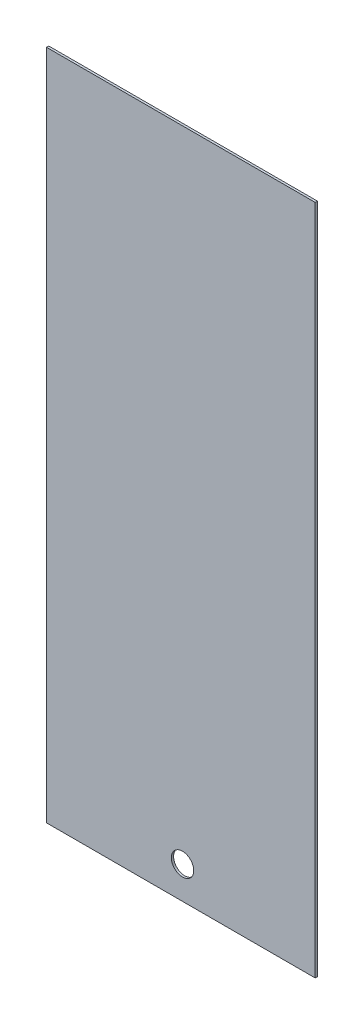
ISO-10303-21;
HEADER;
FILE_DESCRIPTION(('STEP AP214'),'2;1');
FILE_NAME('part.step','',(''),(''),'','','');
FILE_SCHEMA(('AUTOMOTIVE_DESIGN { 1 0 10303 214 1 1 1 1 }'));
ENDSEC;
DATA;
#1=APPLICATION_CONTEXT('core data for automotive mechanical design processes');
#2=APPLICATION_PROTOCOL_DEFINITION('international standard','automotive_design',2000,#1);
#3=PRODUCT_CONTEXT('',#1,'mechanical');
#4=PRODUCT('Part','Part','',(#3));
#5=PRODUCT_RELATED_PRODUCT_CATEGORY('part','',(#4));
#6=PRODUCT_DEFINITION_FORMATION('','',#4);
#7=PRODUCT_DEFINITION_CONTEXT('part definition',#1,'design');
#8=PRODUCT_DEFINITION('design','',#6,#7);
#9=PRODUCT_DEFINITION_SHAPE('','',#8);
#10=(LENGTH_UNIT() NAMED_UNIT(*) SI_UNIT(.MILLI.,.METRE.));
#11=(NAMED_UNIT(*) PLANE_ANGLE_UNIT() SI_UNIT($,.RADIAN.));
#12=(NAMED_UNIT(*) SI_UNIT($,.STERADIAN.) SOLID_ANGLE_UNIT());
#13=UNCERTAINTY_MEASURE_WITH_UNIT(LENGTH_MEASURE(1.E-05),#10,'distance_accuracy_value','');
#14=(GEOMETRIC_REPRESENTATION_CONTEXT(3) GLOBAL_UNCERTAINTY_ASSIGNED_CONTEXT((#13)) GLOBAL_UNIT_ASSIGNED_CONTEXT((#10,
#11,#12)) REPRESENTATION_CONTEXT('',''));
#15=CARTESIAN_POINT('',(0.,0.,0.));
#16=DIRECTION('',(0.,0.,1.));
#17=DIRECTION('',(1.,0.,0.));
#18=AXIS2_PLACEMENT_3D('',#15,#16,#17);
#19=CARTESIAN_POINT('',(-177.468407310705,180.253785900783,2.54));
#20=DIRECTION('',(1.,0.,0.));
#21=DIRECTION('',(0.,1.,0.));
#22=AXIS2_PLACEMENT_3D('',#19,#20,#21);
#23=PLANE('',#22);
#24=DIRECTION('',(0.,-1.,0.));
#25=VECTOR('',#24,1.);
#26=CARTESIAN_POINT('',(-177.468407310705,180.253785900783,0.));
#27=LINE('',#26,#25);
#28=CARTESIAN_POINT('',(-177.468407310705,180.253785900783,0.));
#29=VERTEX_POINT('',#28);
#30=CARTESIAN_POINT('',(-177.468407310705,-581.746214099217,0.));
#31=VERTEX_POINT('',#30);
#32=EDGE_CURVE('E96',#29,#31,#27,.T.);
#33=ORIENTED_EDGE('',*,*,#32,.T.);
#34=DIRECTION('',(0.,0.,-1.));
#35=VECTOR('',#34,1.);
#36=CARTESIAN_POINT('',(-177.468407310705,-581.746214099217,2.54));
#37=LINE('',#36,#35);
#38=CARTESIAN_POINT('',(-177.468407310705,-581.746214099217,2.54));
#39=VERTEX_POINT('',#38);
#40=EDGE_CURVE('E11',#39,#31,#37,.T.);
#41=ORIENTED_EDGE('',*,*,#40,.F.);
#42=DIRECTION('',(0.,-1.,0.));
#43=VECTOR('',#42,1.);
#44=CARTESIAN_POINT('',(-177.468407310705,180.253785900783,2.54));
#45=LINE('',#44,#43);
#46=CARTESIAN_POINT('',(-177.468407310705,180.253785900783,2.54));
#47=VERTEX_POINT('',#46);
#48=EDGE_CURVE('E84',#47,#39,#45,.T.);
#49=ORIENTED_EDGE('',*,*,#48,.F.);
#50=DIRECTION('',(0.,0.,-1.));
#51=VECTOR('',#50,1.);
#52=CARTESIAN_POINT('',(-177.468407310705,180.253785900783,2.54));
#53=LINE('',#52,#51);
#54=EDGE_CURVE('E92',#47,#29,#53,.T.);
#55=ORIENTED_EDGE('',*,*,#54,.T.);
#56=EDGE_LOOP('',(#33,#41,#49,#55));
#57=FACE_BOUND('',#56,.T.);
#58=ADVANCED_FACE('F33',(#57),#23,.F.);
#59=CARTESIAN_POINT('',(-177.468407310705,-581.746214099217,2.54));
#60=DIRECTION('',(0.,1.,0.));
#61=DIRECTION('',(0.,0.,1.));
#62=AXIS2_PLACEMENT_3D('',#59,#60,#61);
#63=PLANE('',#62);
#64=DIRECTION('',(1.,0.,0.));
#65=VECTOR('',#64,1.);
#66=CARTESIAN_POINT('',(-177.468407310705,-581.746214099217,0.));
#67=LINE('',#66,#65);
#68=CARTESIAN_POINT('',(127.331592689295,-581.746214099217,0.));
#69=VERTEX_POINT('',#68);
#70=EDGE_CURVE('E88',#31,#69,#67,.T.);
#71=ORIENTED_EDGE('',*,*,#70,.T.);
#72=DIRECTION('',(0.,0.,-1.));
#73=VECTOR('',#72,1.);
#74=CARTESIAN_POINT('',(127.331592689295,-581.746214099217,2.54));
#75=LINE('',#74,#73);
#76=CARTESIAN_POINT('',(127.331592689295,-581.746214099217,2.54));
#77=VERTEX_POINT('',#76);
#78=EDGE_CURVE('E41',#77,#69,#75,.T.);
#79=ORIENTED_EDGE('',*,*,#78,.F.);
#80=DIRECTION('',(1.,0.,0.));
#81=VECTOR('',#80,1.);
#82=CARTESIAN_POINT('',(-177.468407310705,-581.746214099217,2.54));
#83=LINE('',#82,#81);
#84=EDGE_CURVE('E79',#39,#77,#83,.T.);
#85=ORIENTED_EDGE('',*,*,#84,.F.);
#86=ORIENTED_EDGE('',*,*,#40,.T.);
#87=EDGE_LOOP('',(#71,#79,#85,#86));
#88=FACE_BOUND('',#87,.T.);
#89=ADVANCED_FACE('F87',(#88),#63,.F.);
#90=CARTESIAN_POINT('',(127.331592689295,180.253785900783,2.54));
#91=DIRECTION('',(-1.,0.,0.));
#92=DIRECTION('',(0.,-1.,0.));
#93=AXIS2_PLACEMENT_3D('',#90,#91,#92);
#94=PLANE('',#93);
#95=DIRECTION('',(0.,1.,0.));
#96=VECTOR('',#95,1.);
#97=CARTESIAN_POINT('',(127.331592689295,180.253785900783,0.));
#98=LINE('',#97,#96);
#99=CARTESIAN_POINT('',(127.331592689295,180.253785900783,0.));
#100=VERTEX_POINT('',#99);
#101=EDGE_CURVE('E66',#69,#100,#98,.T.);
#102=ORIENTED_EDGE('',*,*,#101,.T.);
#103=DIRECTION('',(0.,0.,-1.));
#104=VECTOR('',#103,1.);
#105=CARTESIAN_POINT('',(127.331592689295,180.253785900783,2.54));
#106=LINE('',#105,#104);
#107=CARTESIAN_POINT('',(127.331592689295,180.253785900783,2.54));
#108=VERTEX_POINT('',#107);
#109=EDGE_CURVE('E89',#108,#100,#106,.T.);
#110=ORIENTED_EDGE('',*,*,#109,.F.);
#111=DIRECTION('',(0.,1.,0.));
#112=VECTOR('',#111,1.);
#113=CARTESIAN_POINT('',(127.331592689295,180.253785900783,2.54));
#114=LINE('',#113,#112);
#115=EDGE_CURVE('E82',#77,#108,#114,.T.);
#116=ORIENTED_EDGE('',*,*,#115,.F.);
#117=ORIENTED_EDGE('',*,*,#78,.T.);
#118=EDGE_LOOP('',(#102,#110,#116,#117));
#119=FACE_BOUND('',#118,.T.);
#120=ADVANCED_FACE('F90',(#119),#94,.F.);
#121=CARTESIAN_POINT('',(-177.468407310705,180.253785900783,2.54));
#122=DIRECTION('',(0.,-1.,0.));
#123=DIRECTION('',(0.,0.,-1.));
#124=AXIS2_PLACEMENT_3D('',#121,#122,#123);
#125=PLANE('',#124);
#126=DIRECTION('',(-1.,0.,0.));
#127=VECTOR('',#126,1.);
#128=CARTESIAN_POINT('',(-177.468407310705,180.253785900783,0.));
#129=LINE('',#128,#127);
#130=EDGE_CURVE('E72',#100,#29,#129,.T.);
#131=ORIENTED_EDGE('',*,*,#130,.T.);
#132=ORIENTED_EDGE('',*,*,#54,.F.);
#133=DIRECTION('',(-1.,0.,0.));
#134=VECTOR('',#133,1.);
#135=CARTESIAN_POINT('',(-177.468407310705,180.253785900783,2.54));
#136=LINE('',#135,#134);
#137=EDGE_CURVE('E49',#108,#47,#136,.T.);
#138=ORIENTED_EDGE('',*,*,#137,.F.);
#139=ORIENTED_EDGE('',*,*,#109,.T.);
#140=EDGE_LOOP('',(#131,#132,#138,#139));
#141=FACE_BOUND('',#140,.T.);
#142=ADVANCED_FACE('F104',(#141),#125,.F.);
#143=CARTESIAN_POINT('',(0.,0.,2.54));
#144=DIRECTION('',(0.,0.,1.));
#145=DIRECTION('',(1.,0.,0.));
#146=AXIS2_PLACEMENT_3D('',#143,#144,#145);
#147=PLANE('',#146);
#148=CARTESIAN_POINT('',(-23.1931932312567,-545.162860091337,2.54));
#149=DIRECTION('',(0.,0.,1.));
#150=DIRECTION('',(1.,0.,0.));
#151=AXIS2_PLACEMENT_3D('',#148,#149,#150);
#152=CIRCLE('',#151,12.7);
#153=CARTESIAN_POINT('',(-10.4931932312567,-545.162860091337,2.54));
#154=VERTEX_POINT('',#153);
#155=EDGE_CURVE('E110',#154,#154,#152,.T.);
#156=ORIENTED_EDGE('',*,*,#155,.F.);
#157=EDGE_LOOP('',(#156));
#158=FACE_BOUND('',#157,.T.);
#159=ORIENTED_EDGE('',*,*,#48,.T.);
#160=ORIENTED_EDGE('',*,*,#84,.T.);
#161=ORIENTED_EDGE('',*,*,#115,.T.);
#162=ORIENTED_EDGE('',*,*,#137,.T.);
#163=EDGE_LOOP('',(#159,#160,#161,#162));
#164=FACE_BOUND('',#163,.T.);
#165=ADVANCED_FACE('F80',(#158,#164),#147,.T.);
#166=CARTESIAN_POINT('',(0.,0.,0.));
#167=DIRECTION('',(0.,0.,1.));
#168=DIRECTION('',(1.,0.,0.));
#169=AXIS2_PLACEMENT_3D('',#166,#167,#168);
#170=PLANE('',#169);
#171=CARTESIAN_POINT('',(-23.1931932312567,-545.162860091337,0.));
#172=DIRECTION('',(0.,0.,1.));
#173=DIRECTION('',(1.,0.,0.));
#174=AXIS2_PLACEMENT_3D('',#171,#172,#173);
#175=CIRCLE('',#174,12.7);
#176=CARTESIAN_POINT('',(-10.4931932312567,-545.162860091337,0.));
#177=VERTEX_POINT('',#176);
#178=EDGE_CURVE('E99',#177,#177,#175,.T.);
#179=ORIENTED_EDGE('',*,*,#178,.T.);
#180=EDGE_LOOP('',(#179));
#181=FACE_BOUND('',#180,.T.);
#182=ORIENTED_EDGE('',*,*,#32,.F.);
#183=ORIENTED_EDGE('',*,*,#130,.F.);
#184=ORIENTED_EDGE('',*,*,#101,.F.);
#185=ORIENTED_EDGE('',*,*,#70,.F.);
#186=EDGE_LOOP('',(#182,#183,#184,#185));
#187=FACE_BOUND('',#186,.T.);
#188=ADVANCED_FACE('F107',(#181,#187),#170,.F.);
#189=CARTESIAN_POINT('',(-23.1931932312567,-545.162860091337,0.));
#190=DIRECTION('',(0.,0.,1.));
#191=DIRECTION('',(1.,0.,0.));
#192=AXIS2_PLACEMENT_3D('',#189,#190,#191);
#193=CYLINDRICAL_SURFACE('',#192,12.7);
#194=ORIENTED_EDGE('',*,*,#178,.F.);
#195=EDGE_LOOP('',(#194));
#196=FACE_BOUND('',#195,.T.);
#197=ORIENTED_EDGE('',*,*,#155,.T.);
#198=EDGE_LOOP('',(#197));
#199=FACE_BOUND('',#198,.T.);
#200=ADVANCED_FACE('F117',(#196,#199),#193,.F.);
#201=CLOSED_SHELL('',(#58,#89,#120,#142,#165,#188,#200));
#202=MANIFOLD_SOLID_BREP('B2',#201);
#203=ADVANCED_BREP_SHAPE_REPRESENTATION('',(#18,#202),#14);
#204=SHAPE_DEFINITION_REPRESENTATION(#9,#203);
ENDSEC;
END-ISO-10303-21;
